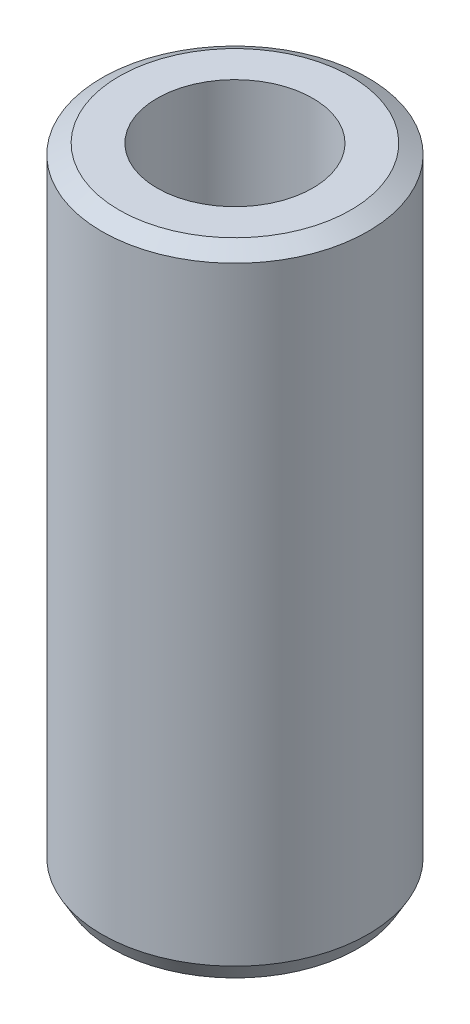
ISO-10303-21;
HEADER;
FILE_DESCRIPTION(('STEP AP214'),'2;1');
FILE_NAME('part.step','',(''),(''),'','','');
FILE_SCHEMA(('AUTOMOTIVE_DESIGN { 1 0 10303 214 1 1 1 1 }'));
ENDSEC;
DATA;
#1=APPLICATION_CONTEXT('core data for automotive mechanical design processes');
#2=APPLICATION_PROTOCOL_DEFINITION('international standard','automotive_design',2000,#1);
#3=PRODUCT_CONTEXT('',#1,'mechanical');
#4=PRODUCT('Part','Part','',(#3));
#5=PRODUCT_RELATED_PRODUCT_CATEGORY('part','',(#4));
#6=PRODUCT_DEFINITION_FORMATION('','',#4);
#7=PRODUCT_DEFINITION_CONTEXT('part definition',#1,'design');
#8=PRODUCT_DEFINITION('design','',#6,#7);
#9=PRODUCT_DEFINITION_SHAPE('','',#8);
#10=(LENGTH_UNIT() NAMED_UNIT(*) SI_UNIT(.MILLI.,.METRE.));
#11=(NAMED_UNIT(*) PLANE_ANGLE_UNIT() SI_UNIT($,.RADIAN.));
#12=(NAMED_UNIT(*) SI_UNIT($,.STERADIAN.) SOLID_ANGLE_UNIT());
#13=UNCERTAINTY_MEASURE_WITH_UNIT(LENGTH_MEASURE(1.E-05),#10,'distance_accuracy_value','');
#14=(GEOMETRIC_REPRESENTATION_CONTEXT(3) GLOBAL_UNCERTAINTY_ASSIGNED_CONTEXT((#13)) GLOBAL_UNIT_ASSIGNED_CONTEXT((#10,
#11,#12)) REPRESENTATION_CONTEXT('',''));
#15=CARTESIAN_POINT('',(0.,0.,0.));
#16=DIRECTION('',(0.,0.,1.));
#17=DIRECTION('',(1.,0.,0.));
#18=AXIS2_PLACEMENT_3D('',#15,#16,#17);
#19=CARTESIAN_POINT('',(0.,95.5706025374899,0.));
#20=DIRECTION('',(0.,-1.,0.));
#21=DIRECTION('',(0.,0.,-1.));
#22=AXIS2_PLACEMENT_3D('',#19,#20,#21);
#23=CYLINDRICAL_SURFACE('',#22,20.);
#24=CARTESIAN_POINT('',(0.,94.0763633809717,0.));
#25=DIRECTION('',(0.,1.,0.));
#26=DIRECTION('',(0.,0.,1.));
#27=AXIS2_PLACEMENT_3D('',#24,#25,#26);
#28=CIRCLE('',#27,20.);
#29=CARTESIAN_POINT('',(0.,94.0763633809717,20.));
#30=VERTEX_POINT('',#29);
#31=EDGE_CURVE('E50',#30,#30,#28,.F.);
#32=ORIENTED_EDGE('',*,*,#31,.T.);
#33=EDGE_LOOP('',(#32));
#34=FACE_BOUND('',#33,.T.);
#35=CARTESIAN_POINT('',(0.,2.58809813774839,0.));
#36=DIRECTION('',(0.,1.,0.));
#37=DIRECTION('',(0.,0.,1.));
#38=AXIS2_PLACEMENT_3D('',#35,#36,#37);
#39=CIRCLE('',#38,20.);
#40=CARTESIAN_POINT('',(0.,2.58809813774839,20.));
#41=VERTEX_POINT('',#40);
#42=EDGE_CURVE('E51',#41,#41,#39,.T.);
#43=ORIENTED_EDGE('',*,*,#42,.T.);
#44=EDGE_LOOP('',(#43));
#45=FACE_BOUND('',#44,.T.);
#46=ADVANCED_FACE('F39',(#34,#45),#23,.T.);
#47=CARTESIAN_POINT('',(0.,95.5706025374899,0.));
#48=DIRECTION('',(0.,1.,0.));
#49=DIRECTION('',(0.,0.,1.));
#50=AXIS2_PLACEMENT_3D('',#47,#48,#49);
#51=PLANE('',#50);
#52=CARTESIAN_POINT('',(0.,95.5706025374899,0.));
#53=DIRECTION('',(0.,1.,0.));
#54=DIRECTION('',(0.,0.,1.));
#55=AXIS2_PLACEMENT_3D('',#52,#53,#54);
#56=CIRCLE('',#55,17.4119018622516);
#57=CARTESIAN_POINT('',(0.,95.5706025374899,17.4119018622516));
#58=VERTEX_POINT('',#57);
#59=EDGE_CURVE('E54',#58,#58,#56,.T.);
#60=ORIENTED_EDGE('',*,*,#59,.T.);
#61=EDGE_LOOP('',(#60));
#62=FACE_BOUND('',#61,.T.);
#63=CARTESIAN_POINT('',(0.,95.5706025374899,0.));
#64=DIRECTION('',(0.,1.,0.));
#65=DIRECTION('',(0.,0.,1.));
#66=AXIS2_PLACEMENT_3D('',#63,#64,#65);
#67=CIRCLE('',#66,11.7001164094453);
#68=CARTESIAN_POINT('',(0.,95.5706025374899,11.7001164094453));
#69=VERTEX_POINT('',#68);
#70=EDGE_CURVE('E58',#69,#69,#67,.T.);
#71=ORIENTED_EDGE('',*,*,#70,.F.);
#72=EDGE_LOOP('',(#71));
#73=FACE_BOUND('',#72,.T.);
#74=ADVANCED_FACE('F69',(#62,#73),#51,.T.);
#75=CARTESIAN_POINT('',(0.,0.,0.));
#76=DIRECTION('',(0.,1.,0.));
#77=DIRECTION('',(0.,0.,1.));
#78=AXIS2_PLACEMENT_3D('',#75,#76,#77);
#79=PLANE('',#78);
#80=CARTESIAN_POINT('',(0.,0.,0.));
#81=DIRECTION('',(0.,1.,0.));
#82=DIRECTION('',(0.,0.,1.));
#83=AXIS2_PLACEMENT_3D('',#80,#81,#82);
#84=CIRCLE('',#83,18.5057608434818);
#85=CARTESIAN_POINT('',(0.,0.,18.5057608434818));
#86=VERTEX_POINT('',#85);
#87=EDGE_CURVE('E10',#86,#86,#84,.F.);
#88=ORIENTED_EDGE('',*,*,#87,.T.);
#89=EDGE_LOOP('',(#88));
#90=FACE_BOUND('',#89,.T.);
#91=CARTESIAN_POINT('',(0.,0.,0.));
#92=DIRECTION('',(0.,1.,0.));
#93=DIRECTION('',(0.,0.,1.));
#94=AXIS2_PLACEMENT_3D('',#91,#92,#93);
#95=CIRCLE('',#94,11.7001164094453);
#96=CARTESIAN_POINT('',(0.,0.,11.7001164094453));
#97=VERTEX_POINT('',#96);
#98=EDGE_CURVE('E63',#97,#97,#95,.T.);
#99=ORIENTED_EDGE('',*,*,#98,.T.);
#100=EDGE_LOOP('',(#99));
#101=FACE_BOUND('',#100,.T.);
#102=ADVANCED_FACE('F75',(#90,#101),#79,.F.);
#103=CARTESIAN_POINT('',(0.,95.5706025374899,0.));
#104=DIRECTION('',(0.,-1.,0.));
#105=DIRECTION('',(0.,0.,-1.));
#106=AXIS2_PLACEMENT_3D('',#103,#104,#105);
#107=CYLINDRICAL_SURFACE('',#106,11.7001164094453);
#108=ORIENTED_EDGE('',*,*,#70,.T.);
#109=EDGE_LOOP('',(#108));
#110=FACE_BOUND('',#109,.T.);
#111=ORIENTED_EDGE('',*,*,#98,.F.);
#112=EDGE_LOOP('',(#111));
#113=FACE_BOUND('',#112,.T.);
#114=ADVANCED_FACE('F70',(#110,#113),#107,.F.);
#115=CARTESIAN_POINT('',(0.,95.5706025374899,0.));
#116=DIRECTION('',(0.,-1.,0.));
#117=DIRECTION('',(0.,0.,-1.));
#118=AXIS2_PLACEMENT_3D('',#115,#116,#117);
#119=CONICAL_SURFACE('',#118,17.4119018622516,1.0471975511966);
#120=ORIENTED_EDGE('',*,*,#31,.F.);
#121=EDGE_LOOP('',(#120));
#122=FACE_BOUND('',#121,.T.);
#123=ORIENTED_EDGE('',*,*,#59,.F.);
#124=EDGE_LOOP('',(#123));
#125=FACE_BOUND('',#124,.T.);
#126=ADVANCED_FACE('F81',(#122,#125),#119,.T.);
#127=CARTESIAN_POINT('',(0.,2.58809813774839,0.));
#128=DIRECTION('',(0.,1.,0.));
#129=DIRECTION('',(0.,0.,1.));
#130=AXIS2_PLACEMENT_3D('',#127,#128,#129);
#131=CONICAL_SURFACE('',#130,20.,0.523598775598303);
#132=ORIENTED_EDGE('',*,*,#87,.F.);
#133=EDGE_LOOP('',(#132));
#134=FACE_BOUND('',#133,.T.);
#135=ORIENTED_EDGE('',*,*,#42,.F.);
#136=EDGE_LOOP('',(#135));
#137=FACE_BOUND('',#136,.T.);
#138=ADVANCED_FACE('F45',(#134,#137),#131,.T.);
#139=CLOSED_SHELL('',(#46,#74,#102,#114,#126,#138));
#140=MANIFOLD_SOLID_BREP('B2',#139);
#141=ADVANCED_BREP_SHAPE_REPRESENTATION('',(#18,#140),#14);
#142=SHAPE_DEFINITION_REPRESENTATION(#9,#141);
ENDSEC;
END-ISO-10303-21;
